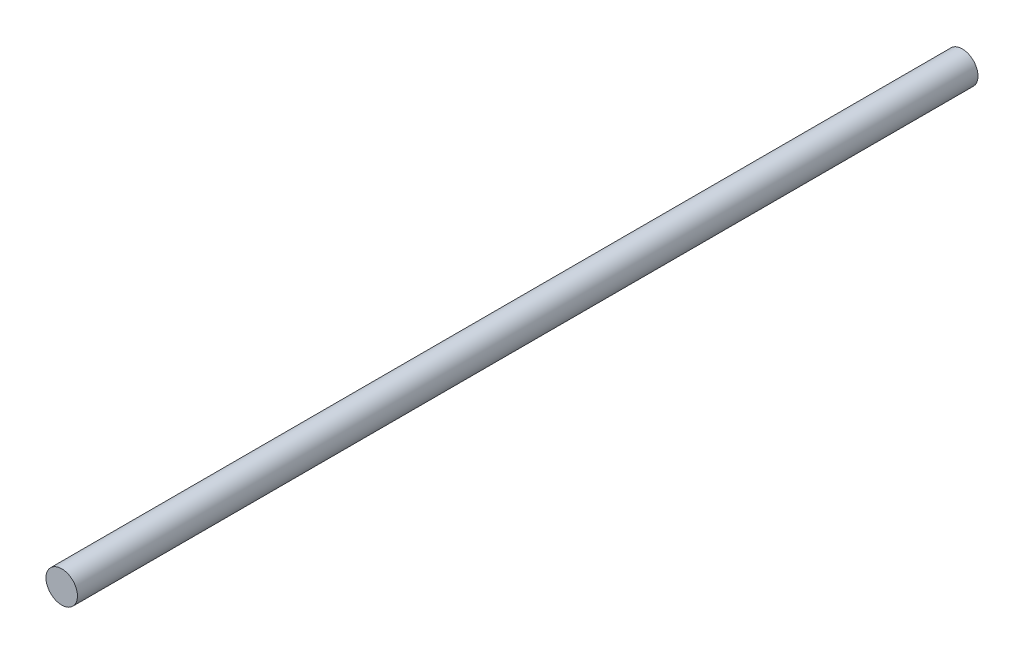
ISO-10303-21;
HEADER;
FILE_DESCRIPTION(('STEP AP214'),'2;1');
FILE_NAME('part.step','',(''),(''),'','','');
FILE_SCHEMA(('AUTOMOTIVE_DESIGN { 1 0 10303 214 1 1 1 1 }'));
ENDSEC;
DATA;
#1=APPLICATION_CONTEXT('core data for automotive mechanical design processes');
#2=APPLICATION_PROTOCOL_DEFINITION('international standard','automotive_design',2000,#1);
#3=PRODUCT_CONTEXT('',#1,'mechanical');
#4=PRODUCT('Part','Part','',(#3));
#5=PRODUCT_RELATED_PRODUCT_CATEGORY('part','',(#4));
#6=PRODUCT_DEFINITION_FORMATION('','',#4);
#7=PRODUCT_DEFINITION_CONTEXT('part definition',#1,'design');
#8=PRODUCT_DEFINITION('design','',#6,#7);
#9=PRODUCT_DEFINITION_SHAPE('','',#8);
#10=(LENGTH_UNIT() NAMED_UNIT(*) SI_UNIT(.MILLI.,.METRE.));
#11=(NAMED_UNIT(*) PLANE_ANGLE_UNIT() SI_UNIT($,.RADIAN.));
#12=(NAMED_UNIT(*) SI_UNIT($,.STERADIAN.) SOLID_ANGLE_UNIT());
#13=UNCERTAINTY_MEASURE_WITH_UNIT(LENGTH_MEASURE(1.E-05),#10,'distance_accuracy_value','');
#14=(GEOMETRIC_REPRESENTATION_CONTEXT(3) GLOBAL_UNCERTAINTY_ASSIGNED_CONTEXT((#13)) GLOBAL_UNIT_ASSIGNED_CONTEXT((#10,
#11,#12)) REPRESENTATION_CONTEXT('',''));
#15=CARTESIAN_POINT('',(0.,0.,0.));
#16=DIRECTION('',(0.,0.,1.));
#17=DIRECTION('',(1.,0.,0.));
#18=AXIS2_PLACEMENT_3D('',#15,#16,#17);
#19=CARTESIAN_POINT('',(0.,0.,286.));
#20=DIRECTION('',(0.,0.,-1.));
#21=DIRECTION('',(-1.,0.,0.));
#22=AXIS2_PLACEMENT_3D('',#19,#20,#21);
#23=CYLINDRICAL_SURFACE('',#22,5.);
#24=CARTESIAN_POINT('',(0.,0.,286.));
#25=DIRECTION('',(0.,0.,1.));
#26=DIRECTION('',(1.,0.,0.));
#27=AXIS2_PLACEMENT_3D('',#24,#25,#26);
#28=CIRCLE('',#27,5.);
#29=CARTESIAN_POINT('',(5.,0.,286.));
#30=VERTEX_POINT('',#29);
#31=EDGE_CURVE('E10',#30,#30,#28,.T.);
#32=ORIENTED_EDGE('',*,*,#31,.F.);
#33=EDGE_LOOP('',(#32));
#34=FACE_BOUND('',#33,.T.);
#35=CARTESIAN_POINT('',(0.,0.,0.));
#36=DIRECTION('',(0.,0.,1.));
#37=DIRECTION('',(1.,0.,0.));
#38=AXIS2_PLACEMENT_3D('',#35,#36,#37);
#39=CIRCLE('',#38,5.);
#40=CARTESIAN_POINT('',(5.,0.,0.));
#41=VERTEX_POINT('',#40);
#42=EDGE_CURVE('E40',#41,#41,#39,.T.);
#43=ORIENTED_EDGE('',*,*,#42,.T.);
#44=EDGE_LOOP('',(#43));
#45=FACE_BOUND('',#44,.T.);
#46=ADVANCED_FACE('F37',(#34,#45),#23,.T.);
#47=CARTESIAN_POINT('',(0.,0.,286.));
#48=DIRECTION('',(0.,0.,1.));
#49=DIRECTION('',(1.,0.,0.));
#50=AXIS2_PLACEMENT_3D('',#47,#48,#49);
#51=PLANE('',#50);
#52=ORIENTED_EDGE('',*,*,#31,.T.);
#53=EDGE_LOOP('',(#52));
#54=FACE_BOUND('',#53,.T.);
#55=ADVANCED_FACE('F52',(#54),#51,.T.);
#56=CARTESIAN_POINT('',(0.,0.,0.));
#57=DIRECTION('',(0.,0.,1.));
#58=DIRECTION('',(1.,0.,0.));
#59=AXIS2_PLACEMENT_3D('',#56,#57,#58);
#60=PLANE('',#59);
#61=ORIENTED_EDGE('',*,*,#42,.F.);
#62=EDGE_LOOP('',(#61));
#63=FACE_BOUND('',#62,.T.);
#64=ADVANCED_FACE('F50',(#63),#60,.F.);
#65=CLOSED_SHELL('',(#46,#55,#64));
#66=MANIFOLD_SOLID_BREP('B2',#65);
#67=ADVANCED_BREP_SHAPE_REPRESENTATION('',(#18,#66),#14);
#68=SHAPE_DEFINITION_REPRESENTATION(#9,#67);
ENDSEC;
END-ISO-10303-21;
